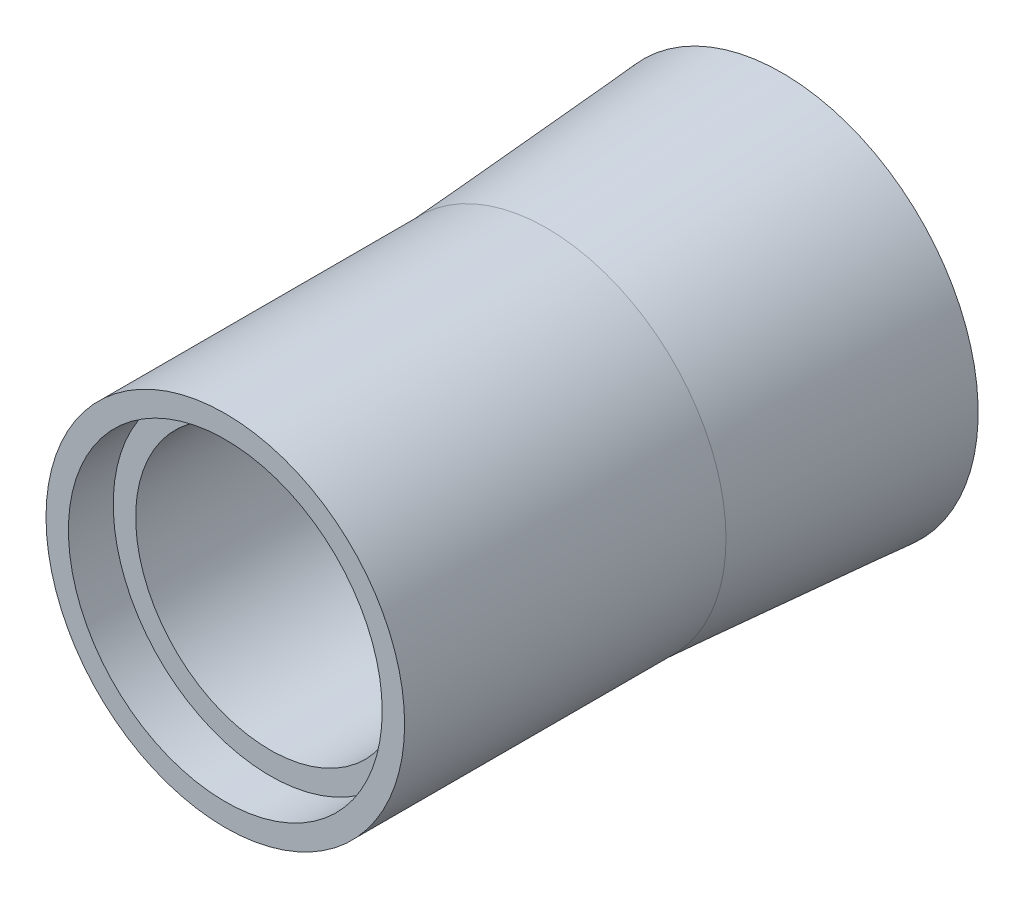
ISO-10303-21;
HEADER;
FILE_DESCRIPTION(('STEP AP214'),'2;1');
FILE_NAME('part.step','',(''),(''),'','','');
FILE_SCHEMA(('AUTOMOTIVE_DESIGN { 1 0 10303 214 1 1 1 1 }'));
ENDSEC;
DATA;
#1=APPLICATION_CONTEXT('core data for automotive mechanical design processes');
#2=APPLICATION_PROTOCOL_DEFINITION('international standard','automotive_design',2000,#1);
#3=PRODUCT_CONTEXT('',#1,'mechanical');
#4=PRODUCT('Part','Part','',(#3));
#5=PRODUCT_RELATED_PRODUCT_CATEGORY('part','',(#4));
#6=PRODUCT_DEFINITION_FORMATION('','',#4);
#7=PRODUCT_DEFINITION_CONTEXT('part definition',#1,'design');
#8=PRODUCT_DEFINITION('design','',#6,#7);
#9=PRODUCT_DEFINITION_SHAPE('','',#8);
#10=(LENGTH_UNIT() NAMED_UNIT(*) SI_UNIT(.MILLI.,.METRE.));
#11=(NAMED_UNIT(*) PLANE_ANGLE_UNIT() SI_UNIT($,.RADIAN.));
#12=(NAMED_UNIT(*) SI_UNIT($,.STERADIAN.) SOLID_ANGLE_UNIT());
#13=UNCERTAINTY_MEASURE_WITH_UNIT(LENGTH_MEASURE(1.E-05),#10,'distance_accuracy_value','');
#14=(GEOMETRIC_REPRESENTATION_CONTEXT(3) GLOBAL_UNCERTAINTY_ASSIGNED_CONTEXT((#13)) GLOBAL_UNIT_ASSIGNED_CONTEXT((#10,
#11,#12)) REPRESENTATION_CONTEXT('',''));
#15=CARTESIAN_POINT('',(0.,0.,0.));
#16=DIRECTION('',(0.,0.,1.));
#17=DIRECTION('',(1.,0.,0.));
#18=AXIS2_PLACEMENT_3D('',#15,#16,#17);
#19=CARTESIAN_POINT('',(0.,0.,157.734));
#20=DIRECTION('',(0.,0.,-1.));
#21=DIRECTION('',(-1.,0.,0.));
#22=AXIS2_PLACEMENT_3D('',#19,#20,#21);
#23=CYLINDRICAL_SURFACE('',#22,50.8);
#24=CARTESIAN_POINT('',(0.,0.,157.734));
#25=DIRECTION('',(0.,0.,1.));
#26=DIRECTION('',(1.,0.,0.));
#27=AXIS2_PLACEMENT_3D('',#24,#25,#26);
#28=CIRCLE('',#27,50.8);
#29=CARTESIAN_POINT('',(50.8,0.,157.734));
#30=VERTEX_POINT('',#29);
#31=EDGE_CURVE('E48',#30,#30,#28,.T.);
#32=ORIENTED_EDGE('',*,*,#31,.F.);
#33=EDGE_LOOP('',(#32));
#34=FACE_BOUND('',#33,.T.);
#35=CARTESIAN_POINT('',(0.,0.,66.6750000000001));
#36=DIRECTION('',(0.,0.,-1.));
#37=DIRECTION('',(-1.,0.,0.));
#38=AXIS2_PLACEMENT_3D('',#35,#36,#37);
#39=CIRCLE('',#38,50.8);
#40=CARTESIAN_POINT('',(-50.8,0.,66.6750000000001));
#41=VERTEX_POINT('',#40);
#42=EDGE_CURVE('E10',#41,#41,#39,.T.);
#43=ORIENTED_EDGE('',*,*,#42,.F.);
#44=EDGE_LOOP('',(#43));
#45=FACE_BOUND('',#44,.T.);
#46=ADVANCED_FACE('F41',(#34,#45),#23,.T.);
#47=CARTESIAN_POINT('',(0.,0.,157.734));
#48=DIRECTION('',(0.,0.,-1.));
#49=DIRECTION('',(-1.,0.,0.));
#50=AXIS2_PLACEMENT_3D('',#47,#48,#49);
#51=CYLINDRICAL_SURFACE('',#50,38.1);
#52=CARTESIAN_POINT('',(0.,0.,0.));
#53=DIRECTION('',(0.,0.,1.));
#54=DIRECTION('',(1.,0.,0.));
#55=AXIS2_PLACEMENT_3D('',#52,#53,#54);
#56=CIRCLE('',#55,38.1);
#57=CARTESIAN_POINT('',(38.1,0.,0.));
#58=VERTEX_POINT('',#57);
#59=EDGE_CURVE('E53',#58,#58,#56,.T.);
#60=ORIENTED_EDGE('',*,*,#59,.F.);
#61=EDGE_LOOP('',(#60));
#62=FACE_BOUND('',#61,.T.);
#63=CARTESIAN_POINT('',(0.,0.,145.034));
#64=DIRECTION('',(0.,0.,1.));
#65=DIRECTION('',(1.,0.,0.));
#66=AXIS2_PLACEMENT_3D('',#63,#64,#65);
#67=CIRCLE('',#66,38.1);
#68=CARTESIAN_POINT('',(38.1,0.,145.034));
#69=VERTEX_POINT('',#68);
#70=EDGE_CURVE('E59',#69,#69,#67,.T.);
#71=ORIENTED_EDGE('',*,*,#70,.T.);
#72=EDGE_LOOP('',(#71));
#73=FACE_BOUND('',#72,.T.);
#74=ADVANCED_FACE('F94',(#62,#73),#51,.F.);
#75=CARTESIAN_POINT('',(0.,0.,157.734));
#76=DIRECTION('',(0.,0.,1.));
#77=DIRECTION('',(1.,0.,0.));
#78=AXIS2_PLACEMENT_3D('',#75,#76,#77);
#79=PLANE('',#78);
#80=CARTESIAN_POINT('',(0.,0.,157.734));
#81=DIRECTION('',(0.,0.,1.));
#82=DIRECTION('',(1.,0.,0.));
#83=AXIS2_PLACEMENT_3D('',#80,#81,#82);
#84=CIRCLE('',#83,44.45);
#85=CARTESIAN_POINT('',(44.45,0.,157.734));
#86=VERTEX_POINT('',#85);
#87=EDGE_CURVE('E69',#86,#86,#84,.T.);
#88=ORIENTED_EDGE('',*,*,#87,.F.);
#89=EDGE_LOOP('',(#88));
#90=FACE_BOUND('',#89,.T.);
#91=ORIENTED_EDGE('',*,*,#31,.T.);
#92=EDGE_LOOP('',(#91));
#93=FACE_BOUND('',#92,.T.);
#94=ADVANCED_FACE('F99',(#90,#93),#79,.T.);
#95=CARTESIAN_POINT('',(0.,0.,0.));
#96=DIRECTION('',(0.,0.,1.));
#97=DIRECTION('',(1.,0.,0.));
#98=AXIS2_PLACEMENT_3D('',#95,#96,#97);
#99=PLANE('',#98);
#100=ORIENTED_EDGE('',*,*,#59,.T.);
#101=EDGE_LOOP('',(#100));
#102=FACE_BOUND('',#101,.T.);
#103=CARTESIAN_POINT('',(0.,0.,0.));
#104=DIRECTION('',(0.,0.,-1.));
#105=DIRECTION('',(-1.,0.,0.));
#106=AXIS2_PLACEMENT_3D('',#103,#104,#105);
#107=CIRCLE('',#106,55.5625);
#108=CARTESIAN_POINT('',(-55.5625,0.,0.));
#109=VERTEX_POINT('',#108);
#110=EDGE_CURVE('E75',#109,#109,#107,.T.);
#111=ORIENTED_EDGE('',*,*,#110,.T.);
#112=EDGE_LOOP('',(#111));
#113=FACE_BOUND('',#112,.T.);
#114=ADVANCED_FACE('F81',(#102,#113),#99,.F.);
#115=CARTESIAN_POINT('',(0.,0.,145.034));
#116=DIRECTION('',(0.,0.,1.));
#117=DIRECTION('',(1.,0.,0.));
#118=AXIS2_PLACEMENT_3D('',#115,#116,#117);
#119=CYLINDRICAL_SURFACE('',#118,44.45);
#120=CARTESIAN_POINT('',(0.,0.,145.034));
#121=DIRECTION('',(0.,0.,1.));
#122=DIRECTION('',(1.,0.,0.));
#123=AXIS2_PLACEMENT_3D('',#120,#121,#122);
#124=CIRCLE('',#123,44.45);
#125=CARTESIAN_POINT('',(44.45,0.,145.034));
#126=VERTEX_POINT('',#125);
#127=EDGE_CURVE('E64',#126,#126,#124,.T.);
#128=ORIENTED_EDGE('',*,*,#127,.F.);
#129=EDGE_LOOP('',(#128));
#130=FACE_BOUND('',#129,.T.);
#131=ORIENTED_EDGE('',*,*,#87,.T.);
#132=EDGE_LOOP('',(#131));
#133=FACE_BOUND('',#132,.T.);
#134=ADVANCED_FACE('F90',(#130,#133),#119,.F.);
#135=CARTESIAN_POINT('',(0.,0.,145.034));
#136=DIRECTION('',(0.,0.,1.));
#137=DIRECTION('',(1.,0.,0.));
#138=AXIS2_PLACEMENT_3D('',#135,#136,#137);
#139=PLANE('',#138);
#140=ORIENTED_EDGE('',*,*,#70,.F.);
#141=EDGE_LOOP('',(#140));
#142=FACE_BOUND('',#141,.T.);
#143=ORIENTED_EDGE('',*,*,#127,.T.);
#144=EDGE_LOOP('',(#143));
#145=FACE_BOUND('',#144,.T.);
#146=ADVANCED_FACE('F85',(#142,#145),#139,.T.);
#147=CARTESIAN_POINT('',(0.,0.,66.675));
#148=DIRECTION('',(0.,0.,-1.));
#149=DIRECTION('',(-1.,0.,0.));
#150=AXIS2_PLACEMENT_3D('',#147,#148,#149);
#151=CONICAL_SURFACE('',#150,50.8,0.0713074647852903);
#152=ORIENTED_EDGE('',*,*,#110,.F.);
#153=EDGE_LOOP('',(#152));
#154=FACE_BOUND('',#153,.T.);
#155=ORIENTED_EDGE('',*,*,#42,.T.);
#156=EDGE_LOOP('',(#155));
#157=FACE_BOUND('',#156,.T.);
#158=ADVANCED_FACE('F83',(#154,#157),#151,.T.);
#159=CLOSED_SHELL('',(#46,#74,#94,#114,#134,#146,#158));
#160=MANIFOLD_SOLID_BREP('B2',#159);
#161=ADVANCED_BREP_SHAPE_REPRESENTATION('',(#18,#160),#14);
#162=SHAPE_DEFINITION_REPRESENTATION(#9,#161);
ENDSEC;
END-ISO-10303-21;
